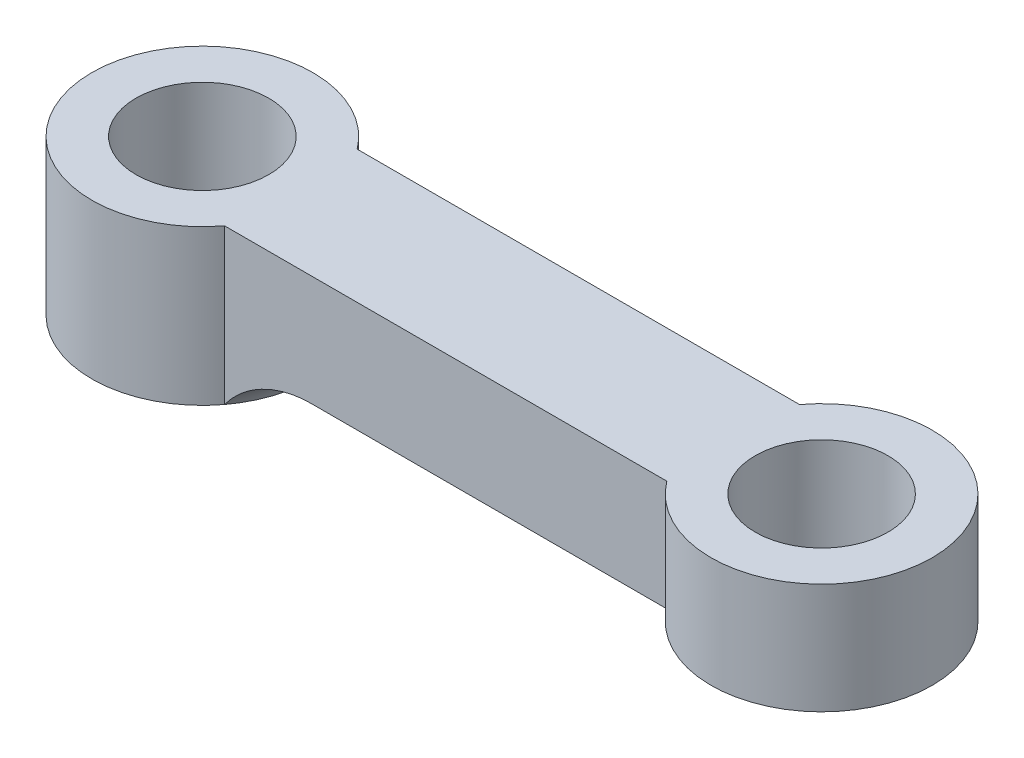
ISO-10303-21;
HEADER;
FILE_DESCRIPTION(('STEP AP214'),'2;1');
FILE_NAME('part.step','',(''),(''),'','','');
FILE_SCHEMA(('AUTOMOTIVE_DESIGN { 1 0 10303 214 1 1 1 1 }'));
ENDSEC;
DATA;
#1=APPLICATION_CONTEXT('core data for automotive mechanical design processes');
#2=APPLICATION_PROTOCOL_DEFINITION('international standard','automotive_design',2000,#1);
#3=PRODUCT_CONTEXT('',#1,'mechanical');
#4=PRODUCT('Part','Part','',(#3));
#5=PRODUCT_RELATED_PRODUCT_CATEGORY('part','',(#4));
#6=PRODUCT_DEFINITION_FORMATION('','',#4);
#7=PRODUCT_DEFINITION_CONTEXT('part definition',#1,'design');
#8=PRODUCT_DEFINITION('design','',#6,#7);
#9=PRODUCT_DEFINITION_SHAPE('','',#8);
#10=(LENGTH_UNIT() NAMED_UNIT(*) SI_UNIT(.MILLI.,.METRE.));
#11=(NAMED_UNIT(*) PLANE_ANGLE_UNIT() SI_UNIT($,.RADIAN.));
#12=(NAMED_UNIT(*) SI_UNIT($,.STERADIAN.) SOLID_ANGLE_UNIT());
#13=UNCERTAINTY_MEASURE_WITH_UNIT(LENGTH_MEASURE(1.E-05),#10,'distance_accuracy_value','');
#14=(GEOMETRIC_REPRESENTATION_CONTEXT(3) GLOBAL_UNCERTAINTY_ASSIGNED_CONTEXT((#13)) GLOBAL_UNIT_ASSIGNED_CONTEXT((#10,
#11,#12)) REPRESENTATION_CONTEXT('',''));
#15=CARTESIAN_POINT('',(0.,0.,0.));
#16=DIRECTION('',(0.,0.,1.));
#17=DIRECTION('',(1.,0.,0.));
#18=AXIS2_PLACEMENT_3D('',#15,#16,#17);
#19=CARTESIAN_POINT('',(0.,10.,-1.5));
#20=DIRECTION('',(0.,0.,1.));
#21=DIRECTION('',(1.,0.,0.));
#22=AXIS2_PLACEMENT_3D('',#19,#20,#21);
#23=PLANE('',#22);
#24=DIRECTION('',(-1.,0.,0.));
#25=VECTOR('',#24,1.);
#26=CARTESIAN_POINT('',(0.,3.25,-1.5));
#27=LINE('',#26,#25);
#28=CARTESIAN_POINT('',(-2.,3.25,-1.5));
#29=VERTEX_POINT('',#28);
#30=CARTESIAN_POINT('',(-12.,3.25,-1.5));
#31=VERTEX_POINT('',#30);
#32=EDGE_CURVE('E113',#29,#31,#27,.T.);
#33=ORIENTED_EDGE('',*,*,#32,.F.);
#34=DIRECTION('',(0.,1.,0.));
#35=VECTOR('',#34,1.);
#36=CARTESIAN_POINT('',(-2.,0.,-1.5));
#37=LINE('',#36,#35);
#38=CARTESIAN_POINT('',(-2.,0.75,-1.5));
#39=VERTEX_POINT('',#38);
#40=EDGE_CURVE('E107',#29,#39,#37,.F.);
#41=ORIENTED_EDGE('',*,*,#40,.T.);
#42=DIRECTION('',(1.,0.,0.));
#43=VECTOR('',#42,1.);
#44=CARTESIAN_POINT('',(0.,0.75,-1.5));
#45=LINE('',#44,#43);
#46=CARTESIAN_POINT('',(-10.0426961150495,0.75,-1.5));
#47=VERTEX_POINT('',#46);
#48=EDGE_CURVE('E91',#47,#39,#45,.T.);
#49=ORIENTED_EDGE('',*,*,#48,.F.);
#50=CARTESIAN_POINT('',(-10.0426961150495,0.75,-1.5));
#51=CARTESIAN_POINT('',(-10.1101588311956,0.749999823016997,-1.5));
#52=CARTESIAN_POINT('',(-10.1775801409873,0.747014129438353,-1.5));
#53=CARTESIAN_POINT('',(-10.3118856193786,0.735220548271376,-1.5));
#54=CARTESIAN_POINT('',(-10.3787699947509,0.726415022654703,-1.5));
#55=CARTESIAN_POINT('',(-10.5777549780728,0.691534344512481,-1.5));
#56=CARTESIAN_POINT('',(-10.7084589449299,0.656993872417429,-1.5));
#57=CARTESIAN_POINT('',(-10.9621875815783,0.567127869653807,-1.5));
#58=CARTESIAN_POINT('',(-11.0852225763054,0.511831020869332,-1.5));
#59=CARTESIAN_POINT('',(-11.3208773784208,0.382328403835823,-1.5));
#60=CARTESIAN_POINT('',(-11.4335002212274,0.30812817026551,-1.5));
#61=CARTESIAN_POINT('',(-11.6266530360967,0.157186019745446,-1.5));
#62=CARTESIAN_POINT('',(-11.70933985547,0.0832007947550352,-1.5));
#63=CARTESIAN_POINT('',(-11.8250261718902,-0.035809661242811,-1.5));
#64=CARTESIAN_POINT('',(-11.862201058815,-0.0768232682359856,-1.5));
#65=CARTESIAN_POINT('',(-11.933483789962,-0.161470320978169,-1.5));
#66=CARTESIAN_POINT('',(-11.9675899316545,-0.205105198885795,-1.5));
#67=CARTESIAN_POINT('',(-12.,-0.25,-1.5));
#68=B_SPLINE_CURVE_WITH_KNOTS('',3,(#50,#51,#52,#53,#54,#55,#56,#57,#58,#59,#60,#61,#62,#63,#64,
#65,#66,#67),.UNSPECIFIED.,.F.,.F.,(4,2,2,2,2,2,2,2,4),(0.,0.202245597207158,0.404409163649031,
0.807932511319444,1.21090029690978,1.6137502338085,1.94554511064099,2.11147708092098,
2.27750054927217),.UNSPECIFIED.);
#69=CARTESIAN_POINT('',(-12.,-0.25,-1.5));
#70=VERTEX_POINT('',#69);
#71=EDGE_CURVE('E12',#47,#70,#68,.T.);
#72=ORIENTED_EDGE('',*,*,#71,.T.);
#73=DIRECTION('',(0.,1.,0.));
#74=VECTOR('',#73,1.);
#75=CARTESIAN_POINT('',(-12.,0.,-1.5));
#76=LINE('',#75,#74);
#77=EDGE_CURVE('E117',#70,#31,#76,.T.);
#78=ORIENTED_EDGE('',*,*,#77,.T.);
#79=EDGE_LOOP('',(#33,#41,#49,#72,#78));
#80=FACE_BOUND('',#79,.T.);
#81=ADVANCED_FACE('F42',(#80),#23,.F.);
#82=CARTESIAN_POINT('',(0.,10.,1.5));
#83=DIRECTION('',(0.,0.,-1.));
#84=DIRECTION('',(-1.,0.,0.));
#85=AXIS2_PLACEMENT_3D('',#82,#83,#84);
#86=PLANE('',#85);
#87=DIRECTION('',(0.,1.,0.));
#88=VECTOR('',#87,1.);
#89=CARTESIAN_POINT('',(-2.,0.,1.5));
#90=LINE('',#89,#88);
#91=CARTESIAN_POINT('',(-2.,0.75,1.5));
#92=VERTEX_POINT('',#91);
#93=CARTESIAN_POINT('',(-2.,3.25,1.5));
#94=VERTEX_POINT('',#93);
#95=EDGE_CURVE('E109',#92,#94,#90,.T.);
#96=ORIENTED_EDGE('',*,*,#95,.T.);
#97=DIRECTION('',(1.,0.,0.));
#98=VECTOR('',#97,1.);
#99=CARTESIAN_POINT('',(0.,3.25,1.5));
#100=LINE('',#99,#98);
#101=CARTESIAN_POINT('',(-12.,3.25,1.5));
#102=VERTEX_POINT('',#101);
#103=EDGE_CURVE('E214',#102,#94,#100,.T.);
#104=ORIENTED_EDGE('',*,*,#103,.F.);
#105=DIRECTION('',(0.,1.,0.));
#106=VECTOR('',#105,1.);
#107=CARTESIAN_POINT('',(-12.,0.,1.5));
#108=LINE('',#107,#106);
#109=CARTESIAN_POINT('',(-12.,-0.25,1.5));
#110=VERTEX_POINT('',#109);
#111=EDGE_CURVE('E115',#102,#110,#108,.F.);
#112=ORIENTED_EDGE('',*,*,#111,.T.);
#113=CARTESIAN_POINT('',(-12.,-0.25,1.5));
#114=CARTESIAN_POINT('',(-11.9603821670225,-0.195133083234195,1.5));
#115=CARTESIAN_POINT('',(-11.9182324428733,-0.142134342559182,1.5));
#116=CARTESIAN_POINT('',(-11.8294505720855,-0.0400858738285198,1.5));
#117=CARTESIAN_POINT('',(-11.7828211969765,0.00896626188012943,1.5));
#118=CARTESIAN_POINT('',(-11.6856157902826,0.102972431061918,1.5));
#119=CARTESIAN_POINT('',(-11.6350401228929,0.147926841877481,1.5));
#120=CARTESIAN_POINT('',(-11.5303878689814,0.233546900001797,1.5));
#121=CARTESIAN_POINT('',(-11.476310663539,0.27421178575013,1.5));
#122=CARTESIAN_POINT('',(-11.3096725979572,0.38927761460712,1.5));
#123=CARTESIAN_POINT('',(-11.1924126120528,0.457030559426616,1.5));
#124=CARTESIAN_POINT('',(-10.9486301593189,0.572703803729169,1.5));
#125=CARTESIAN_POINT('',(-10.8221154459686,0.620640486019132,1.5));
#126=CARTESIAN_POINT('',(-10.5870402030246,0.688000825324204,1.5));
#127=CARTESIAN_POINT('',(-10.4795191725658,0.711070248185485,1.5));
#128=CARTESIAN_POINT('',(-10.262267176796,0.742092084812443,1.5));
#129=CARTESIAN_POINT('',(-10.1525349746802,0.75003578675648,1.5));
#130=CARTESIAN_POINT('',(-10.0426961150495,0.75,1.5));
#131=B_SPLINE_CURVE_WITH_KNOTS('',3,(#113,#114,#115,#116,#117,#118,#119,#120,#121,#122,#123,
#124,#125,#126,#127,#128,#129,#130),.UNSPECIFIED.,.F.,.F.,(4,2,2,2,2,2,2,2,4),(0.,
0.202904886027701,0.405685034884591,0.608446491657607,0.811243886237485,1.2156359605035,
1.61969303763154,1.94856671473686,2.2776297529455),.UNSPECIFIED.);
#132=CARTESIAN_POINT('',(-10.0426961150495,0.75,1.5));
#133=VERTEX_POINT('',#132);
#134=EDGE_CURVE('E55',#110,#133,#131,.T.);
#135=ORIENTED_EDGE('',*,*,#134,.T.);
#136=DIRECTION('',(-1.,0.,0.));
#137=VECTOR('',#136,1.);
#138=CARTESIAN_POINT('',(0.,0.75,1.5));
#139=LINE('',#138,#137);
#140=EDGE_CURVE('E100',#92,#133,#139,.T.);
#141=ORIENTED_EDGE('',*,*,#140,.F.);
#142=EDGE_LOOP('',(#96,#104,#112,#135,#141));
#143=FACE_BOUND('',#142,.T.);
#144=ADVANCED_FACE('F129',(#143),#86,.F.);
#145=CARTESIAN_POINT('',(-14.,10.,0.));
#146=DIRECTION('',(0.,-1.,0.));
#147=DIRECTION('',(0.,0.,-1.));
#148=AXIS2_PLACEMENT_3D('',#145,#146,#147);
#149=CYLINDRICAL_SURFACE('',#148,1.5);
#150=CARTESIAN_POINT('',(-14.,3.25,0.));
#151=DIRECTION('',(0.,1.,0.));
#152=DIRECTION('',(0.,0.,1.));
#153=AXIS2_PLACEMENT_3D('',#150,#151,#152);
#154=CIRCLE('',#153,1.5);
#155=CARTESIAN_POINT('',(-14.,3.25,1.5));
#156=VERTEX_POINT('',#155);
#157=EDGE_CURVE('E119',#156,#156,#154,.F.);
#158=ORIENTED_EDGE('',*,*,#157,.F.);
#159=EDGE_LOOP('',(#158));
#160=FACE_BOUND('',#159,.T.);
#161=CARTESIAN_POINT('',(-14.,-0.25,0.));
#162=DIRECTION('',(0.,-1.,0.));
#163=DIRECTION('',(0.,0.,-1.));
#164=AXIS2_PLACEMENT_3D('',#161,#162,#163);
#165=CIRCLE('',#164,1.5);
#166=CARTESIAN_POINT('',(-14.,-0.25,-1.5));
#167=VERTEX_POINT('',#166);
#168=EDGE_CURVE('E201',#167,#167,#165,.T.);
#169=ORIENTED_EDGE('',*,*,#168,.T.);
#170=EDGE_LOOP('',(#169));
#171=FACE_BOUND('',#170,.T.);
#172=ADVANCED_FACE('F133',(#160,#171),#149,.F.);
#173=CARTESIAN_POINT('',(-14.,0.,0.));
#174=DIRECTION('',(0.,1.,0.));
#175=DIRECTION('',(0.,0.,1.));
#176=AXIS2_PLACEMENT_3D('',#173,#174,#175);
#177=CYLINDRICAL_SURFACE('',#176,2.5);
#178=CARTESIAN_POINT('',(-14.,-0.25,0.));
#179=DIRECTION('',(0.,-1.,0.));
#180=DIRECTION('',(0.,0.,-1.));
#181=AXIS2_PLACEMENT_3D('',#178,#179,#180);
#182=CIRCLE('',#181,2.5);
#183=EDGE_CURVE('E198',#110,#70,#182,.T.);
#184=ORIENTED_EDGE('',*,*,#183,.F.);
#185=ORIENTED_EDGE('',*,*,#111,.F.);
#186=CARTESIAN_POINT('',(-14.,3.25,0.));
#187=DIRECTION('',(0.,1.,0.));
#188=DIRECTION('',(0.,0.,1.));
#189=AXIS2_PLACEMENT_3D('',#186,#187,#188);
#190=CIRCLE('',#189,2.5);
#191=EDGE_CURVE('E211',#31,#102,#190,.T.);
#192=ORIENTED_EDGE('',*,*,#191,.F.);
#193=ORIENTED_EDGE('',*,*,#77,.F.);
#194=EDGE_LOOP('',(#184,#185,#192,#193));
#195=FACE_BOUND('',#194,.T.);
#196=ADVANCED_FACE('F155',(#195),#177,.T.);
#197=CARTESIAN_POINT('',(0.,0.,0.));
#198=DIRECTION('',(0.,1.,0.));
#199=DIRECTION('',(0.,0.,1.));
#200=AXIS2_PLACEMENT_3D('',#197,#198,#199);
#201=CYLINDRICAL_SURFACE('',#200,2.5);
#202=ORIENTED_EDGE('',*,*,#95,.F.);
#203=CARTESIAN_POINT('',(0.,0.75,0.));
#204=DIRECTION('',(0.,-1.,0.));
#205=DIRECTION('',(0.,0.,-1.));
#206=AXIS2_PLACEMENT_3D('',#203,#204,#205);
#207=CIRCLE('',#206,2.5);
#208=EDGE_CURVE('E95',#39,#92,#207,.T.);
#209=ORIENTED_EDGE('',*,*,#208,.F.);
#210=ORIENTED_EDGE('',*,*,#40,.F.);
#211=CARTESIAN_POINT('',(0.,3.25,0.));
#212=DIRECTION('',(0.,1.,0.));
#213=DIRECTION('',(0.,0.,1.));
#214=AXIS2_PLACEMENT_3D('',#211,#212,#213);
#215=CIRCLE('',#214,2.5);
#216=EDGE_CURVE('E212',#94,#29,#215,.T.);
#217=ORIENTED_EDGE('',*,*,#216,.F.);
#218=EDGE_LOOP('',(#202,#209,#210,#217));
#219=FACE_BOUND('',#218,.T.);
#220=ADVANCED_FACE('F105',(#219),#201,.T.);
#221=CARTESIAN_POINT('',(0.,0.,0.));
#222=DIRECTION('',(0.,1.,0.));
#223=DIRECTION('',(0.,0.,1.));
#224=AXIS2_PLACEMENT_3D('',#221,#222,#223);
#225=CYLINDRICAL_SURFACE('',#224,1.5);
#226=CARTESIAN_POINT('',(0.,3.25,0.));
#227=DIRECTION('',(0.,1.,0.));
#228=DIRECTION('',(0.,0.,1.));
#229=AXIS2_PLACEMENT_3D('',#226,#227,#228);
#230=CIRCLE('',#229,1.5);
#231=CARTESIAN_POINT('',(0.,3.25,1.5));
#232=VERTEX_POINT('',#231);
#233=EDGE_CURVE('E206',#232,#232,#230,.F.);
#234=ORIENTED_EDGE('',*,*,#233,.F.);
#235=EDGE_LOOP('',(#234));
#236=FACE_BOUND('',#235,.T.);
#237=CARTESIAN_POINT('',(0.,0.75,0.));
#238=DIRECTION('',(0.,-1.,0.));
#239=DIRECTION('',(0.,0.,-1.));
#240=AXIS2_PLACEMENT_3D('',#237,#238,#239);
#241=CIRCLE('',#240,1.5);
#242=CARTESIAN_POINT('',(0.,0.75,-1.5));
#243=VERTEX_POINT('',#242);
#244=EDGE_CURVE('E101',#243,#243,#241,.F.);
#245=ORIENTED_EDGE('',*,*,#244,.F.);
#246=EDGE_LOOP('',(#245));
#247=FACE_BOUND('',#246,.T.);
#248=ADVANCED_FACE('F223',(#236,#247),#225,.F.);
#249=CARTESIAN_POINT('',(0.,3.25,0.));
#250=DIRECTION('',(0.,1.,0.));
#251=DIRECTION('',(0.,0.,1.));
#252=AXIS2_PLACEMENT_3D('',#249,#250,#251);
#253=PLANE('',#252);
#254=ORIENTED_EDGE('',*,*,#103,.T.);
#255=ORIENTED_EDGE('',*,*,#216,.T.);
#256=ORIENTED_EDGE('',*,*,#32,.T.);
#257=ORIENTED_EDGE('',*,*,#191,.T.);
#258=EDGE_LOOP('',(#254,#255,#256,#257));
#259=FACE_BOUND('',#258,.T.);
#260=ORIENTED_EDGE('',*,*,#157,.T.);
#261=EDGE_LOOP('',(#260));
#262=FACE_BOUND('',#261,.T.);
#263=ORIENTED_EDGE('',*,*,#233,.T.);
#264=EDGE_LOOP('',(#263));
#265=FACE_BOUND('',#264,.T.);
#266=ADVANCED_FACE('F172',(#259,#262,#265),#253,.T.);
#267=CARTESIAN_POINT('',(0.,0.75,0.));
#268=DIRECTION('',(0.,-1.,0.));
#269=DIRECTION('',(0.,0.,-1.));
#270=AXIS2_PLACEMENT_3D('',#267,#268,#269);
#271=PLANE('',#270);
#272=ORIENTED_EDGE('',*,*,#140,.T.);
#273=CARTESIAN_POINT('',(-14.,0.75,0.));
#274=DIRECTION('',(0.,-1.,0.));
#275=DIRECTION('',(0.,0.,-1.));
#276=AXIS2_PLACEMENT_3D('',#273,#274,#275);
#277=CIRCLE('',#276,4.23205080756888);
#278=EDGE_CURVE('E68',#133,#47,#277,.F.);
#279=ORIENTED_EDGE('',*,*,#278,.T.);
#280=ORIENTED_EDGE('',*,*,#48,.T.);
#281=ORIENTED_EDGE('',*,*,#208,.T.);
#282=EDGE_LOOP('',(#272,#279,#280,#281));
#283=FACE_BOUND('',#282,.T.);
#284=ORIENTED_EDGE('',*,*,#244,.T.);
#285=EDGE_LOOP('',(#284));
#286=FACE_BOUND('',#285,.T.);
#287=ADVANCED_FACE('F93',(#283,#286),#271,.T.);
#288=CARTESIAN_POINT('',(-14.,-0.25,0.));
#289=DIRECTION('',(0.,-1.,0.));
#290=DIRECTION('',(0.,0.,-1.));
#291=AXIS2_PLACEMENT_3D('',#288,#289,#290);
#292=PLANE('',#291);
#293=EDGE_CURVE('E110',#70,#110,#182,.T.);
#294=ORIENTED_EDGE('',*,*,#293,.T.);
#295=ORIENTED_EDGE('',*,*,#183,.T.);
#296=EDGE_LOOP('',(#294,#295));
#297=FACE_BOUND('',#296,.T.);
#298=ORIENTED_EDGE('',*,*,#168,.F.);
#299=EDGE_LOOP('',(#298));
#300=FACE_BOUND('',#299,.T.);
#301=ADVANCED_FACE('F171',(#297,#300),#292,.T.);
#302=CARTESIAN_POINT('',(-14.,-1.25,0.));
#303=DIRECTION('',(0.,-1.,0.));
#304=DIRECTION('',(0.,0.,-1.));
#305=AXIS2_PLACEMENT_3D('',#302,#303,#304);
#306=TOROIDAL_SURFACE('',#305,4.23205080756888,2.);
#307=ORIENTED_EDGE('',*,*,#71,.F.);
#308=ORIENTED_EDGE('',*,*,#278,.F.);
#309=ORIENTED_EDGE('',*,*,#134,.F.);
#310=ORIENTED_EDGE('',*,*,#293,.F.);
#311=EDGE_LOOP('',(#307,#308,#309,#310));
#312=FACE_BOUND('',#311,.T.);
#313=ADVANCED_FACE('F44',(#312),#306,.F.);
#314=CLOSED_SHELL('',(#81,#144,#172,#196,#220,#248,#266,#287,#301,#313));
#315=MANIFOLD_SOLID_BREP('B2',#314);
#316=ADVANCED_BREP_SHAPE_REPRESENTATION('',(#18,#315),#14);
#317=SHAPE_DEFINITION_REPRESENTATION(#9,#316);
ENDSEC;
END-ISO-10303-21;
